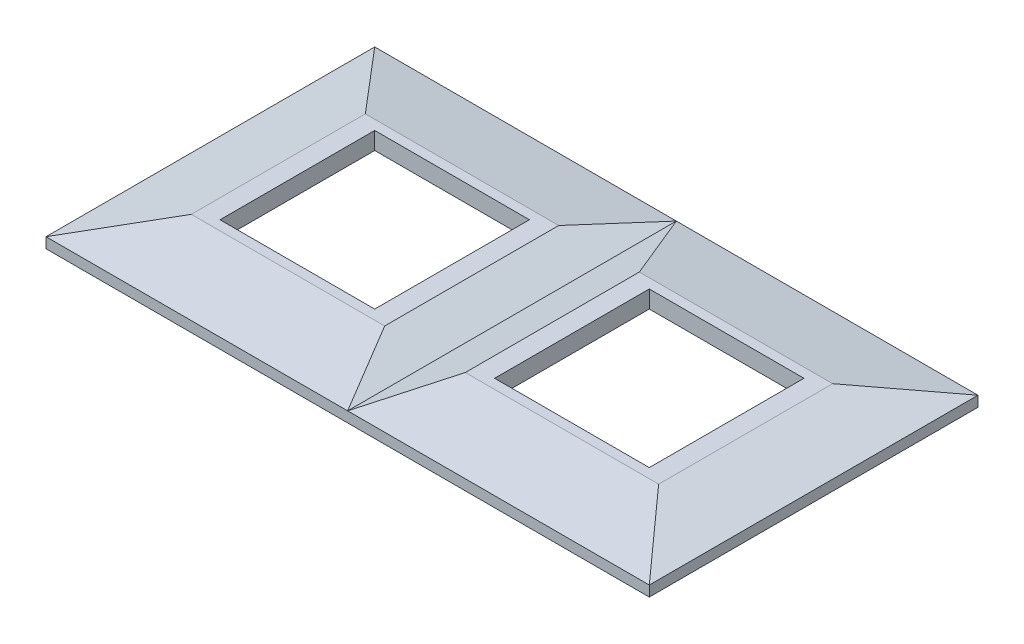
ISO-10303-21;
HEADER;
FILE_DESCRIPTION(('STEP AP214'),'2;1');
FILE_NAME('part.step','',(''),(''),'','','');
FILE_SCHEMA(('AUTOMOTIVE_DESIGN { 1 0 10303 214 1 1 1 1 }'));
ENDSEC;
DATA;
#1=APPLICATION_CONTEXT('core data for automotive mechanical design processes');
#2=APPLICATION_PROTOCOL_DEFINITION('international standard','automotive_design',2000,#1);
#3=PRODUCT_CONTEXT('',#1,'mechanical');
#4=PRODUCT('Part','Part','',(#3));
#5=PRODUCT_RELATED_PRODUCT_CATEGORY('part','',(#4));
#6=PRODUCT_DEFINITION_FORMATION('','',#4);
#7=PRODUCT_DEFINITION_CONTEXT('part definition',#1,'design');
#8=PRODUCT_DEFINITION('design','',#6,#7);
#9=PRODUCT_DEFINITION_SHAPE('','',#8);
#10=(LENGTH_UNIT() NAMED_UNIT(*) SI_UNIT(.MILLI.,.METRE.));
#11=(NAMED_UNIT(*) PLANE_ANGLE_UNIT() SI_UNIT($,.RADIAN.));
#12=(NAMED_UNIT(*) SI_UNIT($,.STERADIAN.) SOLID_ANGLE_UNIT());
#13=UNCERTAINTY_MEASURE_WITH_UNIT(LENGTH_MEASURE(1.E-05),#10,'distance_accuracy_value','');
#14=(GEOMETRIC_REPRESENTATION_CONTEXT(3) GLOBAL_UNCERTAINTY_ASSIGNED_CONTEXT((#13)) GLOBAL_UNIT_ASSIGNED_CONTEXT((#10,
#11,#12)) REPRESENTATION_CONTEXT('',''));
#15=CARTESIAN_POINT('',(0.,0.,0.));
#16=DIRECTION('',(0.,0.,1.));
#17=DIRECTION('',(1.,0.,0.));
#18=AXIS2_PLACEMENT_3D('',#15,#16,#17);
#19=CARTESIAN_POINT('',(55.5,6.5,20.));
#20=DIRECTION('',(1.,0.,0.));
#21=DIRECTION('',(0.,0.,-1.));
#22=AXIS2_PLACEMENT_3D('',#19,#20,#21);
#23=PLANE('',#22);
#24=DIRECTION('',(0.,0.,-1.));
#25=VECTOR('',#24,1.);
#26=CARTESIAN_POINT('',(55.5,2.,20.));
#27=LINE('',#26,#25);
#28=CARTESIAN_POINT('',(55.5,2.,20.));
#29=VERTEX_POINT('',#28);
#30=CARTESIAN_POINT('',(55.5,2.,-20.));
#31=VERTEX_POINT('',#30);
#32=EDGE_CURVE('E225',#29,#31,#27,.T.);
#33=ORIENTED_EDGE('',*,*,#32,.F.);
#34=DIRECTION('',(0.,-1.,0.));
#35=VECTOR('',#34,1.);
#36=CARTESIAN_POINT('',(55.5,6.5,20.));
#37=LINE('',#36,#35);
#38=CARTESIAN_POINT('',(55.5,6.5,20.));
#39=VERTEX_POINT('',#38);
#40=EDGE_CURVE('E265',#39,#29,#37,.T.);
#41=ORIENTED_EDGE('',*,*,#40,.F.);
#42=DIRECTION('',(0.,0.,1.));
#43=VECTOR('',#42,1.);
#44=CARTESIAN_POINT('',(55.5,6.5,20.));
#45=LINE('',#44,#43);
#46=CARTESIAN_POINT('',(55.5,6.5,-20.));
#47=VERTEX_POINT('',#46);
#48=EDGE_CURVE('E227',#47,#39,#45,.T.);
#49=ORIENTED_EDGE('',*,*,#48,.F.);
#50=DIRECTION('',(0.,-1.,0.));
#51=VECTOR('',#50,1.);
#52=CARTESIAN_POINT('',(55.5,6.5,-20.));
#53=LINE('',#52,#51);
#54=EDGE_CURVE('E232',#47,#31,#53,.T.);
#55=ORIENTED_EDGE('',*,*,#54,.T.);
#56=EDGE_LOOP('',(#33,#41,#49,#55));
#57=FACE_BOUND('',#56,.T.);
#58=ADVANCED_FACE('F34',(#57),#23,.F.);
#59=CARTESIAN_POINT('',(55.5,6.5,-20.));
#60=DIRECTION('',(0.,0.,-1.));
#61=DIRECTION('',(-1.,0.,0.));
#62=AXIS2_PLACEMENT_3D('',#59,#60,#61);
#63=PLANE('',#62);
#64=DIRECTION('',(-1.,0.,0.));
#65=VECTOR('',#64,1.);
#66=CARTESIAN_POINT('',(55.5,2.,-20.));
#67=LINE('',#66,#65);
#68=CARTESIAN_POINT('',(15.5,2.,-20.));
#69=VERTEX_POINT('',#68);
#70=EDGE_CURVE('E223',#31,#69,#67,.T.);
#71=ORIENTED_EDGE('',*,*,#70,.F.);
#72=ORIENTED_EDGE('',*,*,#54,.F.);
#73=DIRECTION('',(1.,0.,0.));
#74=VECTOR('',#73,1.);
#75=CARTESIAN_POINT('',(55.5,6.5,-20.));
#76=LINE('',#75,#74);
#77=CARTESIAN_POINT('',(15.5,6.5,-20.));
#78=VERTEX_POINT('',#77);
#79=EDGE_CURVE('E262',#78,#47,#76,.T.);
#80=ORIENTED_EDGE('',*,*,#79,.F.);
#81=DIRECTION('',(0.,-1.,0.));
#82=VECTOR('',#81,1.);
#83=CARTESIAN_POINT('',(15.5,6.5,-20.));
#84=LINE('',#83,#82);
#85=EDGE_CURVE('E268',#78,#69,#84,.T.);
#86=ORIENTED_EDGE('',*,*,#85,.T.);
#87=EDGE_LOOP('',(#71,#72,#80,#86));
#88=FACE_BOUND('',#87,.T.);
#89=ADVANCED_FACE('F413',(#88),#63,.F.);
#90=CARTESIAN_POINT('',(15.5,6.5,20.));
#91=DIRECTION('',(-1.,0.,0.));
#92=DIRECTION('',(0.,0.,1.));
#93=AXIS2_PLACEMENT_3D('',#90,#91,#92);
#94=PLANE('',#93);
#95=DIRECTION('',(0.,0.,1.));
#96=VECTOR('',#95,1.);
#97=CARTESIAN_POINT('',(15.5,2.,20.));
#98=LINE('',#97,#96);
#99=CARTESIAN_POINT('',(15.5,2.,20.));
#100=VERTEX_POINT('',#99);
#101=EDGE_CURVE('E57',#69,#100,#98,.T.);
#102=ORIENTED_EDGE('',*,*,#101,.F.);
#103=ORIENTED_EDGE('',*,*,#85,.F.);
#104=DIRECTION('',(0.,0.,-1.));
#105=VECTOR('',#104,1.);
#106=CARTESIAN_POINT('',(15.5,6.5,20.));
#107=LINE('',#106,#105);
#108=CARTESIAN_POINT('',(15.5,6.5,20.));
#109=VERTEX_POINT('',#108);
#110=EDGE_CURVE('E259',#109,#78,#107,.T.);
#111=ORIENTED_EDGE('',*,*,#110,.F.);
#112=DIRECTION('',(0.,-1.,0.));
#113=VECTOR('',#112,1.);
#114=CARTESIAN_POINT('',(15.5,6.5,20.));
#115=LINE('',#114,#113);
#116=EDGE_CURVE('E271',#109,#100,#115,.T.);
#117=ORIENTED_EDGE('',*,*,#116,.T.);
#118=EDGE_LOOP('',(#102,#103,#111,#117));
#119=FACE_BOUND('',#118,.T.);
#120=ADVANCED_FACE('F419',(#119),#94,.F.);
#121=CARTESIAN_POINT('',(55.5,6.5,20.));
#122=DIRECTION('',(0.,0.,1.));
#123=DIRECTION('',(1.,0.,0.));
#124=AXIS2_PLACEMENT_3D('',#121,#122,#123);
#125=PLANE('',#124);
#126=DIRECTION('',(1.,0.,0.));
#127=VECTOR('',#126,1.);
#128=CARTESIAN_POINT('',(55.5,2.,20.));
#129=LINE('',#128,#127);
#130=EDGE_CURVE('E220',#100,#29,#129,.T.);
#131=ORIENTED_EDGE('',*,*,#130,.F.);
#132=ORIENTED_EDGE('',*,*,#116,.F.);
#133=DIRECTION('',(-1.,0.,0.));
#134=VECTOR('',#133,1.);
#135=CARTESIAN_POINT('',(55.5,6.5,20.));
#136=LINE('',#135,#134);
#137=EDGE_CURVE('E256',#39,#109,#136,.T.);
#138=ORIENTED_EDGE('',*,*,#137,.F.);
#139=ORIENTED_EDGE('',*,*,#40,.T.);
#140=EDGE_LOOP('',(#131,#132,#138,#139));
#141=FACE_BOUND('',#140,.T.);
#142=ADVANCED_FACE('F425',(#141),#125,.F.);
#143=CARTESIAN_POINT('',(-15.5,6.5,20.));
#144=DIRECTION('',(1.,0.,0.));
#145=DIRECTION('',(0.,0.,-1.));
#146=AXIS2_PLACEMENT_3D('',#143,#144,#145);
#147=PLANE('',#146);
#148=DIRECTION('',(0.,0.,-1.));
#149=VECTOR('',#148,1.);
#150=CARTESIAN_POINT('',(-15.5,2.,20.));
#151=LINE('',#150,#149);
#152=CARTESIAN_POINT('',(-15.5,2.,20.));
#153=VERTEX_POINT('',#152);
#154=CARTESIAN_POINT('',(-15.5,2.,-20.));
#155=VERTEX_POINT('',#154);
#156=EDGE_CURVE('E218',#153,#155,#151,.T.);
#157=ORIENTED_EDGE('',*,*,#156,.F.);
#158=DIRECTION('',(0.,-1.,0.));
#159=VECTOR('',#158,1.);
#160=CARTESIAN_POINT('',(-15.5,6.5,20.));
#161=LINE('',#160,#159);
#162=CARTESIAN_POINT('',(-15.5,6.5,20.));
#163=VERTEX_POINT('',#162);
#164=EDGE_CURVE('E241',#163,#153,#161,.T.);
#165=ORIENTED_EDGE('',*,*,#164,.F.);
#166=DIRECTION('',(0.,0.,1.));
#167=VECTOR('',#166,1.);
#168=CARTESIAN_POINT('',(-15.5,6.5,20.));
#169=LINE('',#168,#167);
#170=CARTESIAN_POINT('',(-15.5,6.5,-20.));
#171=VERTEX_POINT('',#170);
#172=EDGE_CURVE('E228',#171,#163,#169,.T.);
#173=ORIENTED_EDGE('',*,*,#172,.F.);
#174=DIRECTION('',(0.,-1.,0.));
#175=VECTOR('',#174,1.);
#176=CARTESIAN_POINT('',(-15.5,6.5,-20.));
#177=LINE('',#176,#175);
#178=EDGE_CURVE('E242',#171,#155,#177,.T.);
#179=ORIENTED_EDGE('',*,*,#178,.T.);
#180=EDGE_LOOP('',(#157,#165,#173,#179));
#181=FACE_BOUND('',#180,.T.);
#182=ADVANCED_FACE('F462',(#181),#147,.F.);
#183=CARTESIAN_POINT('',(-55.5,6.5,-20.));
#184=DIRECTION('',(0.,0.,-1.));
#185=DIRECTION('',(-1.,0.,0.));
#186=AXIS2_PLACEMENT_3D('',#183,#184,#185);
#187=PLANE('',#186);
#188=DIRECTION('',(-1.,0.,0.));
#189=VECTOR('',#188,1.);
#190=CARTESIAN_POINT('',(-55.5,2.,-20.));
#191=LINE('',#190,#189);
#192=CARTESIAN_POINT('',(-55.5,2.,-20.));
#193=VERTEX_POINT('',#192);
#194=EDGE_CURVE('E216',#155,#193,#191,.T.);
#195=ORIENTED_EDGE('',*,*,#194,.F.);
#196=ORIENTED_EDGE('',*,*,#178,.F.);
#197=DIRECTION('',(1.,0.,0.));
#198=VECTOR('',#197,1.);
#199=CARTESIAN_POINT('',(-55.5,6.5,-20.));
#200=LINE('',#199,#198);
#201=CARTESIAN_POINT('',(-55.5,6.5,-20.));
#202=VERTEX_POINT('',#201);
#203=EDGE_CURVE('E238',#202,#171,#200,.T.);
#204=ORIENTED_EDGE('',*,*,#203,.F.);
#205=DIRECTION('',(0.,-1.,0.));
#206=VECTOR('',#205,1.);
#207=CARTESIAN_POINT('',(-55.5,6.5,-20.));
#208=LINE('',#207,#206);
#209=EDGE_CURVE('E246',#202,#193,#208,.T.);
#210=ORIENTED_EDGE('',*,*,#209,.T.);
#211=EDGE_LOOP('',(#195,#196,#204,#210));
#212=FACE_BOUND('',#211,.T.);
#213=ADVANCED_FACE('F459',(#212),#187,.F.);
#214=CARTESIAN_POINT('',(-55.5,6.5,20.));
#215=DIRECTION('',(-1.,0.,0.));
#216=DIRECTION('',(0.,0.,1.));
#217=AXIS2_PLACEMENT_3D('',#214,#215,#216);
#218=PLANE('',#217);
#219=DIRECTION('',(0.,0.,1.));
#220=VECTOR('',#219,1.);
#221=CARTESIAN_POINT('',(-55.5,2.,20.));
#222=LINE('',#221,#220);
#223=CARTESIAN_POINT('',(-55.5,2.,20.));
#224=VERTEX_POINT('',#223);
#225=EDGE_CURVE('E211',#193,#224,#222,.T.);
#226=ORIENTED_EDGE('',*,*,#225,.F.);
#227=ORIENTED_EDGE('',*,*,#209,.F.);
#228=DIRECTION('',(0.,0.,-1.));
#229=VECTOR('',#228,1.);
#230=CARTESIAN_POINT('',(-55.5,6.5,20.));
#231=LINE('',#230,#229);
#232=CARTESIAN_POINT('',(-55.5,6.49999999999999,20.));
#233=VERTEX_POINT('',#232);
#234=EDGE_CURVE('E235',#233,#202,#231,.T.);
#235=ORIENTED_EDGE('',*,*,#234,.F.);
#236=DIRECTION('',(0.,-1.,0.));
#237=VECTOR('',#236,1.);
#238=CARTESIAN_POINT('',(-55.5,6.5,20.));
#239=LINE('',#238,#237);
#240=EDGE_CURVE('E249',#233,#224,#239,.T.);
#241=ORIENTED_EDGE('',*,*,#240,.T.);
#242=EDGE_LOOP('',(#226,#227,#235,#241));
#243=FACE_BOUND('',#242,.T.);
#244=ADVANCED_FACE('F469',(#243),#218,.F.);
#245=CARTESIAN_POINT('',(-55.5,6.5,20.));
#246=DIRECTION('',(0.,0.,1.));
#247=DIRECTION('',(1.,0.,0.));
#248=AXIS2_PLACEMENT_3D('',#245,#246,#247);
#249=PLANE('',#248);
#250=DIRECTION('',(1.,0.,0.));
#251=VECTOR('',#250,1.);
#252=CARTESIAN_POINT('',(-55.5,2.,20.));
#253=LINE('',#252,#251);
#254=EDGE_CURVE('E12',#224,#153,#253,.T.);
#255=ORIENTED_EDGE('',*,*,#254,.F.);
#256=ORIENTED_EDGE('',*,*,#240,.F.);
#257=DIRECTION('',(-1.,0.,0.));
#258=VECTOR('',#257,1.);
#259=CARTESIAN_POINT('',(-55.5,6.5,20.));
#260=LINE('',#259,#258);
#261=EDGE_CURVE('E231',#163,#233,#260,.T.);
#262=ORIENTED_EDGE('',*,*,#261,.F.);
#263=ORIENTED_EDGE('',*,*,#164,.T.);
#264=EDGE_LOOP('',(#255,#256,#262,#263));
#265=FACE_BOUND('',#264,.T.);
#266=ADVANCED_FACE('F454',(#265),#249,.F.);
#267=CARTESIAN_POINT('',(0.,2.70518054401516,42.5));
#268=DIRECTION('',(-0.342107675752112,-0.939660756971093,0.));
#269=DIRECTION('',(0.939660756971093,-0.342107675752112,0.));
#270=AXIS2_PLACEMENT_3D('',#267,#268,#269);
#271=PLANE('',#270);
#272=DIRECTION('',(-0.455754252305575,0.165929061965923,-0.874503063402579));
#273=VECTOR('',#272,1.);
#274=CARTESIAN_POINT('',(0.,2.70518054401516,42.5));
#275=LINE('',#274,#273);
#276=CARTESIAN_POINT('',(0.,2.70518054401516,42.5));
#277=VERTEX_POINT('',#276);
#278=CARTESIAN_POINT('',(-10.4231596521182,6.49999999999999,22.5));
#279=VERTEX_POINT('',#278);
#280=EDGE_CURVE('E298',#277,#279,#275,.T.);
#281=ORIENTED_EDGE('',*,*,#280,.F.);
#282=DIRECTION('',(0.,0.,-1.));
#283=VECTOR('',#282,1.);
#284=CARTESIAN_POINT('',(0.,2.70518054401516,42.5));
#285=LINE('',#284,#283);
#286=CARTESIAN_POINT('',(0.,2.70518054401516,-42.5));
#287=VERTEX_POINT('',#286);
#288=EDGE_CURVE('E313',#277,#287,#285,.T.);
#289=ORIENTED_EDGE('',*,*,#288,.T.);
#290=DIRECTION('',(0.455754252305575,-0.165929061965923,-0.874503063402579));
#291=VECTOR('',#290,1.);
#292=CARTESIAN_POINT('',(-33.8774716329981,15.039145748736,22.5042266715421));
#293=LINE('',#292,#291);
#294=CARTESIAN_POINT('',(-10.4231596521182,6.5,-22.5));
#295=VERTEX_POINT('',#294);
#296=EDGE_CURVE('E289',#295,#287,#293,.T.);
#297=ORIENTED_EDGE('',*,*,#296,.F.);
#298=DIRECTION('',(0.,0.,-1.));
#299=VECTOR('',#298,1.);
#300=CARTESIAN_POINT('',(-10.4231596521182,6.5,42.5));
#301=LINE('',#300,#299);
#302=EDGE_CURVE('E343',#279,#295,#301,.T.);
#303=ORIENTED_EDGE('',*,*,#302,.F.);
#304=EDGE_LOOP('',(#281,#289,#297,#303));
#305=FACE_BOUND('',#304,.T.);
#306=ADVANCED_FACE('F36',(#305),#271,.F.);
#307=CARTESIAN_POINT('',(-60.4231596521182,6.49999999999999,42.5));
#308=DIRECTION('',(0.,-1.,0.));
#309=DIRECTION('',(1.,0.,0.));
#310=AXIS2_PLACEMENT_3D('',#307,#308,#309);
#311=PLANE('',#310);
#312=ORIENTED_EDGE('',*,*,#203,.T.);
#313=ORIENTED_EDGE('',*,*,#172,.T.);
#314=ORIENTED_EDGE('',*,*,#261,.T.);
#315=ORIENTED_EDGE('',*,*,#234,.T.);
#316=EDGE_LOOP('',(#312,#313,#314,#315));
#317=FACE_BOUND('',#316,.T.);
#318=DIRECTION('',(1.,0.,0.));
#319=VECTOR('',#318,1.);
#320=CARTESIAN_POINT('',(-78.,6.49999999999999,22.5));
#321=LINE('',#320,#319);
#322=CARTESIAN_POINT('',(-60.4231596521182,6.49999999999999,22.5));
#323=VERTEX_POINT('',#322);
#324=EDGE_CURVE('E279',#323,#279,#321,.T.);
#325=ORIENTED_EDGE('',*,*,#324,.T.);
#326=ORIENTED_EDGE('',*,*,#302,.T.);
#327=DIRECTION('',(1.,0.,0.));
#328=VECTOR('',#327,1.);
#329=CARTESIAN_POINT('',(-78.,6.5,-22.5));
#330=LINE('',#329,#328);
#331=CARTESIAN_POINT('',(-60.4231596521182,6.5,-22.5));
#332=VERTEX_POINT('',#331);
#333=EDGE_CURVE('E283',#332,#295,#330,.T.);
#334=ORIENTED_EDGE('',*,*,#333,.F.);
#335=DIRECTION('',(0.,0.,-1.));
#336=VECTOR('',#335,1.);
#337=CARTESIAN_POINT('',(-60.4231596521182,6.49999999999999,42.5));
#338=LINE('',#337,#336);
#339=EDGE_CURVE('E340',#323,#332,#338,.T.);
#340=ORIENTED_EDGE('',*,*,#339,.F.);
#341=EDGE_LOOP('',(#325,#326,#334,#340));
#342=FACE_BOUND('',#341,.T.);
#343=ADVANCED_FACE('F391',(#317,#342),#311,.F.);
#344=CARTESIAN_POINT('',(-78.,2.70518054401515,42.5));
#345=DIRECTION('',(0.211036410501778,-0.977478201006306,0.));
#346=DIRECTION('',(0.977478201006307,0.211036410501778,0.));
#347=AXIS2_PLACEMENT_3D('',#344,#345,#346);
#348=PLANE('',#347);
#349=DIRECTION('',(-0.65353337987008,-0.141097099136216,0.743630102948324));
#350=VECTOR('',#349,1.);
#351=CARTESIAN_POINT('',(-78.,2.70518054401515,42.5));
#352=LINE('',#351,#350);
#353=CARTESIAN_POINT('',(-78.,2.70518054401515,42.5));
#354=VERTEX_POINT('',#353);
#355=EDGE_CURVE('E302',#323,#354,#352,.T.);
#356=ORIENTED_EDGE('',*,*,#355,.F.);
#357=ORIENTED_EDGE('',*,*,#339,.T.);
#358=DIRECTION('',(0.65353337987008,0.141097099136215,0.743630102948324));
#359=VECTOR('',#358,1.);
#360=CARTESIAN_POINT('',(-36.6910969629989,11.6237248243069,4.50378705092943));
#361=LINE('',#360,#359);
#362=CARTESIAN_POINT('',(-78.,2.70518054401516,-42.5));
#363=VERTEX_POINT('',#362);
#364=EDGE_CURVE('E293',#363,#332,#361,.T.);
#365=ORIENTED_EDGE('',*,*,#364,.F.);
#366=DIRECTION('',(0.,0.,-1.));
#367=VECTOR('',#366,1.);
#368=CARTESIAN_POINT('',(-78.,2.70518054401515,42.5));
#369=LINE('',#368,#367);
#370=EDGE_CURVE('E337',#354,#363,#369,.T.);
#371=ORIENTED_EDGE('',*,*,#370,.F.);
#372=EDGE_LOOP('',(#356,#357,#365,#371));
#373=FACE_BOUND('',#372,.T.);
#374=ADVANCED_FACE('F395',(#373),#348,.F.);
#375=CARTESIAN_POINT('',(78.,2.70518054401515,42.5));
#376=DIRECTION('',(-0.211036410501778,-0.977478201006306,0.));
#377=DIRECTION('',(0.977478201006307,-0.211036410501778,0.));
#378=AXIS2_PLACEMENT_3D('',#375,#376,#377);
#379=PLANE('',#378);
#380=DIRECTION('',(-0.65353337987008,0.141097099136216,-0.743630102948324));
#381=VECTOR('',#380,1.);
#382=CARTESIAN_POINT('',(78.,2.70518054401515,42.5));
#383=LINE('',#382,#381);
#384=CARTESIAN_POINT('',(78.,2.70518054401515,42.5));
#385=VERTEX_POINT('',#384);
#386=CARTESIAN_POINT('',(60.4231596521182,6.49999999999999,22.5));
#387=VERTEX_POINT('',#386);
#388=EDGE_CURVE('E300',#385,#387,#383,.T.);
#389=ORIENTED_EDGE('',*,*,#388,.F.);
#390=DIRECTION('',(0.,0.,-1.));
#391=VECTOR('',#390,1.);
#392=CARTESIAN_POINT('',(78.,2.70518054401515,42.5));
#393=LINE('',#392,#391);
#394=CARTESIAN_POINT('',(78.,2.70518054401515,-42.5));
#395=VERTEX_POINT('',#394);
#396=EDGE_CURVE('E328',#385,#395,#393,.T.);
#397=ORIENTED_EDGE('',*,*,#396,.T.);
#398=DIRECTION('',(0.65353337987008,-0.141097099136215,-0.743630102948324));
#399=VECTOR('',#398,1.);
#400=CARTESIAN_POINT('',(36.6910969629989,11.6237248243069,4.50378705092943));
#401=LINE('',#400,#399);
#402=CARTESIAN_POINT('',(60.4231596521182,6.5,-22.5));
#403=VERTEX_POINT('',#402);
#404=EDGE_CURVE('E291',#403,#395,#401,.T.);
#405=ORIENTED_EDGE('',*,*,#404,.F.);
#406=DIRECTION('',(0.,0.,-1.));
#407=VECTOR('',#406,1.);
#408=CARTESIAN_POINT('',(60.4231596521182,6.49999999999999,42.5));
#409=LINE('',#408,#407);
#410=EDGE_CURVE('E325',#387,#403,#409,.T.);
#411=ORIENTED_EDGE('',*,*,#410,.F.);
#412=EDGE_LOOP('',(#389,#397,#405,#411));
#413=FACE_BOUND('',#412,.T.);
#414=ADVANCED_FACE('F358',(#413),#379,.F.);
#415=CARTESIAN_POINT('',(60.4231596521182,6.49999999999999,42.5));
#416=DIRECTION('',(0.,-1.,0.));
#417=DIRECTION('',(1.,0.,0.));
#418=AXIS2_PLACEMENT_3D('',#415,#416,#417);
#419=PLANE('',#418);
#420=ORIENTED_EDGE('',*,*,#79,.T.);
#421=ORIENTED_EDGE('',*,*,#48,.T.);
#422=ORIENTED_EDGE('',*,*,#137,.T.);
#423=ORIENTED_EDGE('',*,*,#110,.T.);
#424=EDGE_LOOP('',(#420,#421,#422,#423));
#425=FACE_BOUND('',#424,.T.);
#426=CARTESIAN_POINT('',(10.4231596521182,6.49999999999999,22.5));
#427=VERTEX_POINT('',#426);
#428=EDGE_CURVE('E280',#427,#387,#321,.T.);
#429=ORIENTED_EDGE('',*,*,#428,.T.);
#430=ORIENTED_EDGE('',*,*,#410,.T.);
#431=CARTESIAN_POINT('',(10.4231596521182,6.5,-22.5));
#432=VERTEX_POINT('',#431);
#433=EDGE_CURVE('E284',#432,#403,#330,.T.);
#434=ORIENTED_EDGE('',*,*,#433,.F.);
#435=DIRECTION('',(0.,0.,-1.));
#436=VECTOR('',#435,1.);
#437=CARTESIAN_POINT('',(10.4231596521182,6.5,42.5));
#438=LINE('',#437,#436);
#439=EDGE_CURVE('E322',#427,#432,#438,.T.);
#440=ORIENTED_EDGE('',*,*,#439,.F.);
#441=EDGE_LOOP('',(#429,#430,#434,#440));
#442=FACE_BOUND('',#441,.T.);
#443=ADVANCED_FACE('F377',(#425,#442),#419,.F.);
#444=CARTESIAN_POINT('',(0.,2.70518054401516,42.5));
#445=DIRECTION('',(0.342107675752113,-0.939660756971093,0.));
#446=DIRECTION('',(0.939660756971093,0.342107675752113,0.));
#447=AXIS2_PLACEMENT_3D('',#444,#445,#446);
#448=PLANE('',#447);
#449=DIRECTION('',(-0.455754252305574,-0.165929061965923,0.874503063402579));
#450=VECTOR('',#449,1.);
#451=CARTESIAN_POINT('',(0.,2.70518054401516,42.5));
#452=LINE('',#451,#450);
#453=EDGE_CURVE('E295',#427,#277,#452,.T.);
#454=ORIENTED_EDGE('',*,*,#453,.F.);
#455=ORIENTED_EDGE('',*,*,#439,.T.);
#456=DIRECTION('',(0.455754252305574,0.165929061965923,0.87450306340258));
#457=VECTOR('',#456,1.);
#458=CARTESIAN_POINT('',(33.877471632998,15.039145748736,22.5042266715422));
#459=LINE('',#458,#457);
#460=EDGE_CURVE('E278',#287,#432,#459,.T.);
#461=ORIENTED_EDGE('',*,*,#460,.F.);
#462=ORIENTED_EDGE('',*,*,#288,.F.);
#463=EDGE_LOOP('',(#454,#455,#461,#462));
#464=FACE_BOUND('',#463,.T.);
#465=ADVANCED_FACE('F380',(#464),#448,.F.);
#466=CARTESIAN_POINT('',(0.,0.,42.5));
#467=DIRECTION('',(0.,0.,-1.));
#468=DIRECTION('',(-1.,0.,0.));
#469=AXIS2_PLACEMENT_3D('',#466,#467,#468);
#470=PLANE('',#469);
#471=DIRECTION('',(1.,0.,0.));
#472=VECTOR('',#471,1.);
#473=CARTESIAN_POINT('',(-78.,2.70518054401515,42.5));
#474=LINE('',#473,#472);
#475=EDGE_CURVE('E276',#354,#277,#474,.T.);
#476=ORIENTED_EDGE('',*,*,#475,.F.);
#477=DIRECTION('',(0.,-1.,0.));
#478=VECTOR('',#477,1.);
#479=CARTESIAN_POINT('',(-78.,0.,42.5));
#480=LINE('',#479,#478);
#481=CARTESIAN_POINT('',(-78.,0.,42.5));
#482=VERTEX_POINT('',#481);
#483=EDGE_CURVE('E305',#354,#482,#480,.T.);
#484=ORIENTED_EDGE('',*,*,#483,.T.);
#485=DIRECTION('',(1.,0.,0.));
#486=VECTOR('',#485,1.);
#487=CARTESIAN_POINT('',(0.,0.,42.5));
#488=LINE('',#487,#486);
#489=CARTESIAN_POINT('',(78.,0.,42.5));
#490=VERTEX_POINT('',#489);
#491=EDGE_CURVE('E307',#482,#490,#488,.T.);
#492=ORIENTED_EDGE('',*,*,#491,.T.);
#493=DIRECTION('',(0.,1.,0.));
#494=VECTOR('',#493,1.);
#495=CARTESIAN_POINT('',(78.,0.,42.5));
#496=LINE('',#495,#494);
#497=EDGE_CURVE('E310',#490,#385,#496,.T.);
#498=ORIENTED_EDGE('',*,*,#497,.T.);
#499=DIRECTION('',(1.,0.,0.));
#500=VECTOR('',#499,1.);
#501=CARTESIAN_POINT('',(0.,2.70518054401515,42.5));
#502=LINE('',#501,#500);
#503=EDGE_CURVE('E42',#277,#385,#502,.T.);
#504=ORIENTED_EDGE('',*,*,#503,.F.);
#505=EDGE_LOOP('',(#476,#484,#492,#498,#504));
#506=FACE_BOUND('',#505,.T.);
#507=ADVANCED_FACE('F362',(#506),#470,.F.);
#508=CARTESIAN_POINT('',(0.,0.,-42.5));
#509=DIRECTION('',(0.,0.,-1.));
#510=DIRECTION('',(-1.,0.,0.));
#511=AXIS2_PLACEMENT_3D('',#508,#509,#510);
#512=PLANE('',#511);
#513=DIRECTION('',(0.,-1.,0.));
#514=VECTOR('',#513,1.);
#515=CARTESIAN_POINT('',(-78.,0.,-42.5));
#516=LINE('',#515,#514);
#517=CARTESIAN_POINT('',(-78.,0.,-42.5));
#518=VERTEX_POINT('',#517);
#519=EDGE_CURVE('E304',#363,#518,#516,.T.);
#520=ORIENTED_EDGE('',*,*,#519,.F.);
#521=DIRECTION('',(1.,0.,0.));
#522=VECTOR('',#521,1.);
#523=CARTESIAN_POINT('',(-78.,2.70518054401516,-42.5));
#524=LINE('',#523,#522);
#525=EDGE_CURVE('E245',#363,#287,#524,.T.);
#526=ORIENTED_EDGE('',*,*,#525,.T.);
#527=DIRECTION('',(1.,0.,0.));
#528=VECTOR('',#527,1.);
#529=CARTESIAN_POINT('',(0.,2.70518054401516,-42.5));
#530=LINE('',#529,#528);
#531=EDGE_CURVE('E346',#287,#395,#530,.T.);
#532=ORIENTED_EDGE('',*,*,#531,.T.);
#533=DIRECTION('',(0.,1.,0.));
#534=VECTOR('',#533,1.);
#535=CARTESIAN_POINT('',(78.,0.,-42.5));
#536=LINE('',#535,#534);
#537=CARTESIAN_POINT('',(78.,0.,-42.5));
#538=VERTEX_POINT('',#537);
#539=EDGE_CURVE('E308',#538,#395,#536,.T.);
#540=ORIENTED_EDGE('',*,*,#539,.F.);
#541=DIRECTION('',(1.,0.,0.));
#542=VECTOR('',#541,1.);
#543=CARTESIAN_POINT('',(0.,0.,-42.5));
#544=LINE('',#543,#542);
#545=EDGE_CURVE('E316',#518,#538,#544,.T.);
#546=ORIENTED_EDGE('',*,*,#545,.F.);
#547=EDGE_LOOP('',(#520,#526,#532,#540,#546));
#548=FACE_BOUND('',#547,.T.);
#549=ADVANCED_FACE('F370',(#548),#512,.T.);
#550=CARTESIAN_POINT('',(-78.,0.,42.5));
#551=DIRECTION('',(1.,0.,0.));
#552=DIRECTION('',(0.,0.,-1.));
#553=AXIS2_PLACEMENT_3D('',#550,#551,#552);
#554=PLANE('',#553);
#555=ORIENTED_EDGE('',*,*,#519,.T.);
#556=DIRECTION('',(0.,0.,-1.));
#557=VECTOR('',#556,1.);
#558=CARTESIAN_POINT('',(-78.,0.,42.5));
#559=LINE('',#558,#557);
#560=EDGE_CURVE('E334',#482,#518,#559,.T.);
#561=ORIENTED_EDGE('',*,*,#560,.F.);
#562=ORIENTED_EDGE('',*,*,#483,.F.);
#563=ORIENTED_EDGE('',*,*,#370,.T.);
#564=EDGE_LOOP('',(#555,#561,#562,#563));
#565=FACE_BOUND('',#564,.T.);
#566=ADVANCED_FACE('F400',(#565),#554,.F.);
#567=CARTESIAN_POINT('',(0.,0.,42.5));
#568=DIRECTION('',(0.,1.,0.));
#569=DIRECTION('',(0.,0.,1.));
#570=AXIS2_PLACEMENT_3D('',#567,#568,#569);
#571=PLANE('',#570);
#572=DIRECTION('',(-1.,0.,0.));
#573=VECTOR('',#572,1.);
#574=CARTESIAN_POINT('',(-76.,0.,41.));
#575=LINE('',#574,#573);
#576=CARTESIAN_POINT('',(76.,0.,41.));
#577=VERTEX_POINT('',#576);
#578=CARTESIAN_POINT('',(-76.,0.,41.));
#579=VERTEX_POINT('',#578);
#580=EDGE_CURVE('E205',#577,#579,#575,.T.);
#581=ORIENTED_EDGE('',*,*,#580,.F.);
#582=DIRECTION('',(0.,0.,1.));
#583=VECTOR('',#582,1.);
#584=CARTESIAN_POINT('',(76.,0.,41.));
#585=LINE('',#584,#583);
#586=CARTESIAN_POINT('',(76.,0.,-41.));
#587=VERTEX_POINT('',#586);
#588=EDGE_CURVE('E49',#587,#577,#585,.T.);
#589=ORIENTED_EDGE('',*,*,#588,.F.);
#590=DIRECTION('',(1.,0.,0.));
#591=VECTOR('',#590,1.);
#592=CARTESIAN_POINT('',(-76.,0.,-41.));
#593=LINE('',#592,#591);
#594=CARTESIAN_POINT('',(-76.,0.,-41.));
#595=VERTEX_POINT('',#594);
#596=EDGE_CURVE('E196',#595,#587,#593,.T.);
#597=ORIENTED_EDGE('',*,*,#596,.F.);
#598=DIRECTION('',(0.,0.,-1.));
#599=VECTOR('',#598,1.);
#600=CARTESIAN_POINT('',(-76.,0.,41.));
#601=LINE('',#600,#599);
#602=EDGE_CURVE('E199',#579,#595,#601,.T.);
#603=ORIENTED_EDGE('',*,*,#602,.F.);
#604=EDGE_LOOP('',(#581,#589,#597,#603));
#605=FACE_BOUND('',#604,.T.);
#606=ORIENTED_EDGE('',*,*,#545,.T.);
#607=DIRECTION('',(0.,0.,-1.));
#608=VECTOR('',#607,1.);
#609=CARTESIAN_POINT('',(78.,0.,42.5));
#610=LINE('',#609,#608);
#611=EDGE_CURVE('E331',#490,#538,#610,.T.);
#612=ORIENTED_EDGE('',*,*,#611,.F.);
#613=ORIENTED_EDGE('',*,*,#491,.F.);
#614=ORIENTED_EDGE('',*,*,#560,.T.);
#615=EDGE_LOOP('',(#606,#612,#613,#614));
#616=FACE_BOUND('',#615,.T.);
#617=ADVANCED_FACE('F402',(#605,#616),#571,.F.);
#618=CARTESIAN_POINT('',(78.,0.,42.5));
#619=DIRECTION('',(-1.,0.,0.));
#620=DIRECTION('',(0.,0.,1.));
#621=AXIS2_PLACEMENT_3D('',#618,#619,#620);
#622=PLANE('',#621);
#623=ORIENTED_EDGE('',*,*,#539,.T.);
#624=ORIENTED_EDGE('',*,*,#396,.F.);
#625=ORIENTED_EDGE('',*,*,#497,.F.);
#626=ORIENTED_EDGE('',*,*,#611,.T.);
#627=EDGE_LOOP('',(#623,#624,#625,#626));
#628=FACE_BOUND('',#627,.T.);
#629=ADVANCED_FACE('F366',(#628),#622,.F.);
#630=CARTESIAN_POINT('',(-78.,2.70518054401516,-42.5));
#631=DIRECTION('',(0.,0.982471088770438,-0.186415020130433));
#632=DIRECTION('',(0.,0.186415020130433,0.982471088770438));
#633=AXIS2_PLACEMENT_3D('',#630,#631,#632);
#634=PLANE('',#633);
#635=ORIENTED_EDGE('',*,*,#404,.T.);
#636=ORIENTED_EDGE('',*,*,#531,.F.);
#637=ORIENTED_EDGE('',*,*,#460,.T.);
#638=ORIENTED_EDGE('',*,*,#433,.T.);
#639=EDGE_LOOP('',(#635,#636,#637,#638));
#640=FACE_BOUND('',#639,.T.);
#641=ADVANCED_FACE('F373',(#640),#634,.T.);
#642=ORIENTED_EDGE('',*,*,#364,.T.);
#643=ORIENTED_EDGE('',*,*,#333,.T.);
#644=ORIENTED_EDGE('',*,*,#296,.T.);
#645=ORIENTED_EDGE('',*,*,#525,.F.);
#646=EDGE_LOOP('',(#642,#643,#644,#645));
#647=FACE_BOUND('',#646,.T.);
#648=ADVANCED_FACE('F429',(#647),#634,.T.);
#649=CARTESIAN_POINT('',(-78.,2.70518054401515,42.5));
#650=DIRECTION('',(0.,0.982471088770438,0.186415020130434));
#651=DIRECTION('',(0.,-0.186415020130434,0.982471088770438));
#652=AXIS2_PLACEMENT_3D('',#649,#650,#651);
#653=PLANE('',#652);
#654=ORIENTED_EDGE('',*,*,#388,.T.);
#655=ORIENTED_EDGE('',*,*,#428,.F.);
#656=ORIENTED_EDGE('',*,*,#453,.T.);
#657=ORIENTED_EDGE('',*,*,#503,.T.);
#658=EDGE_LOOP('',(#654,#655,#656,#657));
#659=FACE_BOUND('',#658,.T.);
#660=ADVANCED_FACE('F351',(#659),#653,.T.);
#661=ORIENTED_EDGE('',*,*,#355,.T.);
#662=ORIENTED_EDGE('',*,*,#475,.T.);
#663=ORIENTED_EDGE('',*,*,#280,.T.);
#664=ORIENTED_EDGE('',*,*,#324,.F.);
#665=EDGE_LOOP('',(#661,#662,#663,#664));
#666=FACE_BOUND('',#665,.T.);
#667=ADVANCED_FACE('F387',(#666),#653,.T.);
#668=CARTESIAN_POINT('',(0.,2.,0.));
#669=DIRECTION('',(0.,-1.,0.));
#670=DIRECTION('',(0.,0.,-1.));
#671=AXIS2_PLACEMENT_3D('',#668,#669,#670);
#672=PLANE('',#671);
#673=ORIENTED_EDGE('',*,*,#156,.T.);
#674=ORIENTED_EDGE('',*,*,#194,.T.);
#675=ORIENTED_EDGE('',*,*,#225,.T.);
#676=ORIENTED_EDGE('',*,*,#254,.T.);
#677=EDGE_LOOP('',(#673,#674,#675,#676));
#678=FACE_BOUND('',#677,.T.);
#679=DIRECTION('',(0.,0.,1.));
#680=VECTOR('',#679,1.);
#681=CARTESIAN_POINT('',(76.,2.,41.));
#682=LINE('',#681,#680);
#683=CARTESIAN_POINT('',(76.,2.,-41.));
#684=VERTEX_POINT('',#683);
#685=CARTESIAN_POINT('',(76.,2.,41.));
#686=VERTEX_POINT('',#685);
#687=EDGE_CURVE('E178',#684,#686,#682,.T.);
#688=ORIENTED_EDGE('',*,*,#687,.T.);
#689=DIRECTION('',(-1.,0.,0.));
#690=VECTOR('',#689,1.);
#691=CARTESIAN_POINT('',(-76.,2.,41.));
#692=LINE('',#691,#690);
#693=CARTESIAN_POINT('',(-76.,2.,41.));
#694=VERTEX_POINT('',#693);
#695=EDGE_CURVE('E187',#686,#694,#692,.T.);
#696=ORIENTED_EDGE('',*,*,#695,.T.);
#697=DIRECTION('',(0.,0.,-1.));
#698=VECTOR('',#697,1.);
#699=CARTESIAN_POINT('',(-76.,2.,41.));
#700=LINE('',#699,#698);
#701=CARTESIAN_POINT('',(-76.,2.,-41.));
#702=VERTEX_POINT('',#701);
#703=EDGE_CURVE('E192',#694,#702,#700,.T.);
#704=ORIENTED_EDGE('',*,*,#703,.T.);
#705=DIRECTION('',(1.,0.,0.));
#706=VECTOR('',#705,1.);
#707=CARTESIAN_POINT('',(-76.,2.,-41.));
#708=LINE('',#707,#706);
#709=EDGE_CURVE('E184',#702,#684,#708,.T.);
#710=ORIENTED_EDGE('',*,*,#709,.T.);
#711=EDGE_LOOP('',(#688,#696,#704,#710));
#712=FACE_BOUND('',#711,.T.);
#713=ORIENTED_EDGE('',*,*,#32,.T.);
#714=ORIENTED_EDGE('',*,*,#70,.T.);
#715=ORIENTED_EDGE('',*,*,#101,.T.);
#716=ORIENTED_EDGE('',*,*,#130,.T.);
#717=EDGE_LOOP('',(#713,#714,#715,#716));
#718=FACE_BOUND('',#717,.T.);
#719=ADVANCED_FACE('F194',(#678,#712,#718),#672,.T.);
#720=CARTESIAN_POINT('',(76.,2.,41.));
#721=DIRECTION('',(1.,0.,0.));
#722=DIRECTION('',(0.,0.,-1.));
#723=AXIS2_PLACEMENT_3D('',#720,#721,#722);
#724=PLANE('',#723);
#725=ORIENTED_EDGE('',*,*,#588,.T.);
#726=DIRECTION('',(0.,-1.,0.));
#727=VECTOR('',#726,1.);
#728=CARTESIAN_POINT('',(76.,2.,41.));
#729=LINE('',#728,#727);
#730=EDGE_CURVE('E174',#686,#577,#729,.T.);
#731=ORIENTED_EDGE('',*,*,#730,.F.);
#732=ORIENTED_EDGE('',*,*,#687,.F.);
#733=DIRECTION('',(0.,-1.,0.));
#734=VECTOR('',#733,1.);
#735=CARTESIAN_POINT('',(76.,2.,-41.));
#736=LINE('',#735,#734);
#737=EDGE_CURVE('E209',#684,#587,#736,.T.);
#738=ORIENTED_EDGE('',*,*,#737,.T.);
#739=EDGE_LOOP('',(#725,#731,#732,#738));
#740=FACE_BOUND('',#739,.T.);
#741=ADVANCED_FACE('F176',(#740),#724,.F.);
#742=CARTESIAN_POINT('',(-76.,2.,-41.));
#743=DIRECTION('',(0.,0.,-1.));
#744=DIRECTION('',(-1.,0.,0.));
#745=AXIS2_PLACEMENT_3D('',#742,#743,#744);
#746=PLANE('',#745);
#747=ORIENTED_EDGE('',*,*,#596,.T.);
#748=ORIENTED_EDGE('',*,*,#737,.F.);
#749=ORIENTED_EDGE('',*,*,#709,.F.);
#750=DIRECTION('',(0.,-1.,0.));
#751=VECTOR('',#750,1.);
#752=CARTESIAN_POINT('',(-76.,2.,-41.));
#753=LINE('',#752,#751);
#754=EDGE_CURVE('E212',#702,#595,#753,.T.);
#755=ORIENTED_EDGE('',*,*,#754,.T.);
#756=EDGE_LOOP('',(#747,#748,#749,#755));
#757=FACE_BOUND('',#756,.T.);
#758=ADVANCED_FACE('F476',(#757),#746,.F.);
#759=CARTESIAN_POINT('',(-76.,2.,41.));
#760=DIRECTION('',(-1.,0.,0.));
#761=DIRECTION('',(0.,0.,1.));
#762=AXIS2_PLACEMENT_3D('',#759,#760,#761);
#763=PLANE('',#762);
#764=ORIENTED_EDGE('',*,*,#602,.T.);
#765=ORIENTED_EDGE('',*,*,#754,.F.);
#766=ORIENTED_EDGE('',*,*,#703,.F.);
#767=DIRECTION('',(0.,-1.,0.));
#768=VECTOR('',#767,1.);
#769=CARTESIAN_POINT('',(-76.,2.,41.));
#770=LINE('',#769,#768);
#771=EDGE_CURVE('E183',#694,#579,#770,.T.);
#772=ORIENTED_EDGE('',*,*,#771,.T.);
#773=EDGE_LOOP('',(#764,#765,#766,#772));
#774=FACE_BOUND('',#773,.T.);
#775=ADVANCED_FACE('F481',(#774),#763,.F.);
#776=CARTESIAN_POINT('',(-76.,2.,41.));
#777=DIRECTION('',(0.,0.,1.));
#778=DIRECTION('',(1.,0.,0.));
#779=AXIS2_PLACEMENT_3D('',#776,#777,#778);
#780=PLANE('',#779);
#781=ORIENTED_EDGE('',*,*,#580,.T.);
#782=ORIENTED_EDGE('',*,*,#771,.F.);
#783=ORIENTED_EDGE('',*,*,#695,.F.);
#784=ORIENTED_EDGE('',*,*,#730,.T.);
#785=EDGE_LOOP('',(#781,#782,#783,#784));
#786=FACE_BOUND('',#785,.T.);
#787=ADVANCED_FACE('F188',(#786),#780,.F.);
#788=CLOSED_SHELL('',(#58,#89,#120,#142,#182,#213,#244,#266,#306,#343,#374,#414,#443,#465,#507,
#549,#566,#617,#629,#641,#648,#660,#667,#719,#741,#758,#775,#787));
#789=MANIFOLD_SOLID_BREP('B2',#788);
#790=ADVANCED_BREP_SHAPE_REPRESENTATION('',(#18,#789),#14);
#791=SHAPE_DEFINITION_REPRESENTATION(#9,#790);
ENDSEC;
END-ISO-10303-21;
